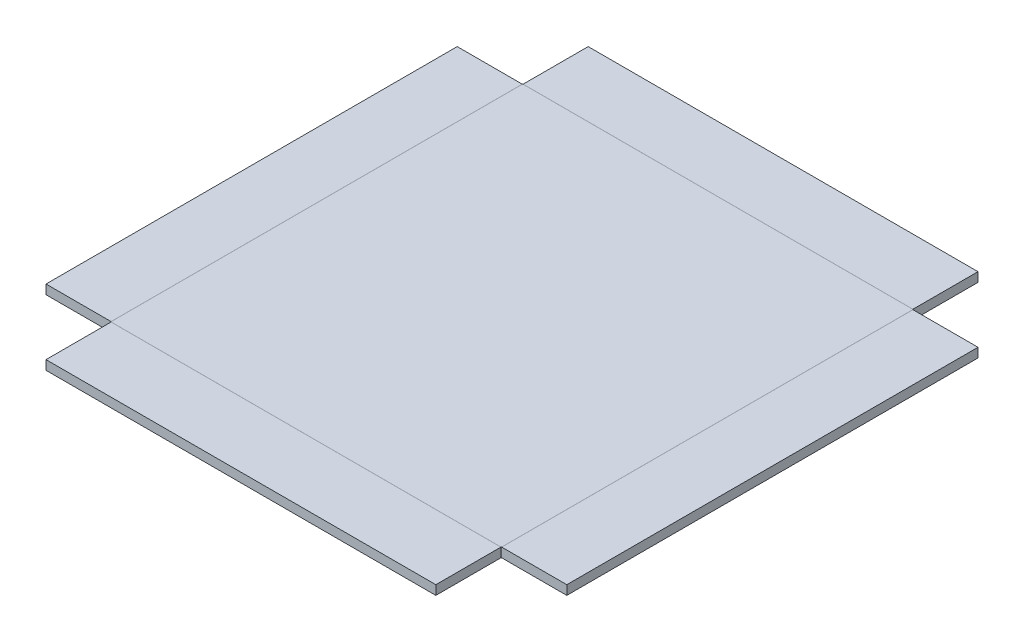
ISO-10303-21;
HEADER;
FILE_DESCRIPTION(('STEP AP214'),'2;1');
FILE_NAME('part.step','',(''),(''),'','','');
FILE_SCHEMA(('AUTOMOTIVE_DESIGN { 1 0 10303 214 1 1 1 1 }'));
ENDSEC;
DATA;
#1=APPLICATION_CONTEXT('core data for automotive mechanical design processes');
#2=APPLICATION_PROTOCOL_DEFINITION('international standard','automotive_design',2000,#1);
#3=PRODUCT_CONTEXT('',#1,'mechanical');
#4=PRODUCT('Part','Part','',(#3));
#5=PRODUCT_RELATED_PRODUCT_CATEGORY('part','',(#4));
#6=PRODUCT_DEFINITION_FORMATION('','',#4);
#7=PRODUCT_DEFINITION_CONTEXT('part definition',#1,'design');
#8=PRODUCT_DEFINITION('design','',#6,#7);
#9=PRODUCT_DEFINITION_SHAPE('','',#8);
#10=(LENGTH_UNIT() NAMED_UNIT(*) SI_UNIT(.MILLI.,.METRE.));
#11=(NAMED_UNIT(*) PLANE_ANGLE_UNIT() SI_UNIT($,.RADIAN.));
#12=(NAMED_UNIT(*) SI_UNIT($,.STERADIAN.) SOLID_ANGLE_UNIT());
#13=UNCERTAINTY_MEASURE_WITH_UNIT(LENGTH_MEASURE(1.E-05),#10,'distance_accuracy_value','');
#14=(GEOMETRIC_REPRESENTATION_CONTEXT(3) GLOBAL_UNCERTAINTY_ASSIGNED_CONTEXT((#13)) GLOBAL_UNIT_ASSIGNED_CONTEXT((#10,
#11,#12)) REPRESENTATION_CONTEXT('',''));
#15=CARTESIAN_POINT('',(0.,0.,0.));
#16=DIRECTION('',(0.,0.,1.));
#17=DIRECTION('',(1.,0.,0.));
#18=AXIS2_PLACEMENT_3D('',#15,#16,#17);
#19=CARTESIAN_POINT('',(0.,-0.254,0.));
#20=DIRECTION('',(0.,-1.,0.));
#21=DIRECTION('',(0.,0.,-1.));
#22=AXIS2_PLACEMENT_3D('',#19,#20,#21);
#23=PLANE('',#22);
#24=DIRECTION('',(0.,0.,-1.));
#25=VECTOR('',#24,1.);
#26=CARTESIAN_POINT('',(5.334,-0.254,5.6261));
#27=LINE('',#26,#25);
#28=CARTESIAN_POINT('',(5.334,-0.254,5.6261));
#29=VERTEX_POINT('',#28);
#30=CARTESIAN_POINT('',(5.334,-0.254,-5.6261));
#31=VERTEX_POINT('',#30);
#32=EDGE_CURVE('E337',#29,#31,#27,.T.);
#33=ORIENTED_EDGE('',*,*,#32,.F.);
#34=DIRECTION('',(1.,0.,0.));
#35=VECTOR('',#34,1.);
#36=CARTESIAN_POINT('',(-5.334,-0.254,5.6261));
#37=LINE('',#36,#35);
#38=CARTESIAN_POINT('',(-5.334,-0.254,5.6261));
#39=VERTEX_POINT('',#38);
#40=EDGE_CURVE('E702',#39,#29,#37,.T.);
#41=ORIENTED_EDGE('',*,*,#40,.F.);
#42=DIRECTION('',(0.,0.,1.));
#43=VECTOR('',#42,1.);
#44=CARTESIAN_POINT('',(-5.334,-0.254,5.6261));
#45=LINE('',#44,#43);
#46=CARTESIAN_POINT('',(-5.334,-0.254,-5.6261));
#47=VERTEX_POINT('',#46);
#48=EDGE_CURVE('E692',#47,#39,#45,.T.);
#49=ORIENTED_EDGE('',*,*,#48,.F.);
#50=DIRECTION('',(-1.,0.,0.));
#51=VECTOR('',#50,1.);
#52=CARTESIAN_POINT('',(-5.334,-0.254,-5.6261));
#53=LINE('',#52,#51);
#54=EDGE_CURVE('E344',#31,#47,#53,.T.);
#55=ORIENTED_EDGE('',*,*,#54,.F.);
#56=EDGE_LOOP('',(#33,#41,#49,#55));
#57=FACE_BOUND('',#56,.T.);
#58=ADVANCED_FACE('F329',(#57),#23,.T.);
#59=CARTESIAN_POINT('',(0.,0.,0.));
#60=DIRECTION('',(0.,-1.,0.));
#61=DIRECTION('',(0.,0.,-1.));
#62=AXIS2_PLACEMENT_3D('',#59,#60,#61);
#63=PLANE('',#62);
#64=DIRECTION('',(0.,0.,-1.));
#65=VECTOR('',#64,1.);
#66=CARTESIAN_POINT('',(5.334,0.,5.6261));
#67=LINE('',#66,#65);
#68=CARTESIAN_POINT('',(5.334,0.,5.62609999999999));
#69=VERTEX_POINT('',#68);
#70=CARTESIAN_POINT('',(5.33399999999999,0.,-5.6261));
#71=VERTEX_POINT('',#70);
#72=EDGE_CURVE('E704',#69,#71,#67,.T.);
#73=ORIENTED_EDGE('',*,*,#72,.T.);
#74=DIRECTION('',(-1.,0.,0.));
#75=VECTOR('',#74,1.);
#76=CARTESIAN_POINT('',(-5.334,0.,-5.6261));
#77=LINE('',#76,#75);
#78=CARTESIAN_POINT('',(-5.334,0.,-5.62609999999999));
#79=VERTEX_POINT('',#78);
#80=EDGE_CURVE('E675',#71,#79,#77,.T.);
#81=ORIENTED_EDGE('',*,*,#80,.T.);
#82=DIRECTION('',(0.,0.,1.));
#83=VECTOR('',#82,1.);
#84=CARTESIAN_POINT('',(-5.334,0.,5.6261));
#85=LINE('',#84,#83);
#86=CARTESIAN_POINT('',(-5.33399999999998,0.,5.6261));
#87=VERTEX_POINT('',#86);
#88=EDGE_CURVE('E682',#79,#87,#85,.T.);
#89=ORIENTED_EDGE('',*,*,#88,.T.);
#90=DIRECTION('',(1.,0.,0.));
#91=VECTOR('',#90,1.);
#92=CARTESIAN_POINT('',(-5.334,0.,5.6261));
#93=LINE('',#92,#91);
#94=EDGE_CURVE('E695',#87,#69,#93,.T.);
#95=ORIENTED_EDGE('',*,*,#94,.T.);
#96=EDGE_LOOP('',(#73,#81,#89,#95));
#97=FACE_BOUND('',#96,.T.);
#98=ADVANCED_FACE('F331',(#97),#63,.F.);
#99=CARTESIAN_POINT('',(-5.334,-0.254,-5.6261));
#100=DIRECTION('',(0.216857826546622,0.,0.976203197631249));
#101=DIRECTION('',(0.976203197631249,0.,-0.216857826546622));
#102=AXIS2_PLACEMENT_3D('',#99,#100,#101);
#103=PLANE('',#102);
#104=DIRECTION('',(0.,1.,0.));
#105=VECTOR('',#104,1.);
#106=CARTESIAN_POINT('',(-5.334,-0.254,-5.6261));
#107=LINE('',#106,#105);
#108=EDGE_CURVE('E689',#47,#79,#107,.T.);
#109=ORIENTED_EDGE('',*,*,#108,.T.);
#110=DIRECTION('',(0.976203197631249,0.,-0.216857826546622));
#111=VECTOR('',#110,1.);
#112=CARTESIAN_POINT('',(-5.334,0.,-5.62609999999999));
#113=LINE('',#112,#111);
#114=CARTESIAN_POINT('',(-5.32501974387893,0.,-5.62809491133502));
#115=VERTEX_POINT('',#114);
#116=EDGE_CURVE('E678',#79,#115,#113,.T.);
#117=ORIENTED_EDGE('',*,*,#116,.T.);
#118=DIRECTION('',(0.,1.,0.));
#119=VECTOR('',#118,1.);
#120=CARTESIAN_POINT('',(-5.32501974387893,-0.254,-5.62809491133503));
#121=LINE('',#120,#119);
#122=CARTESIAN_POINT('',(-5.32501974387893,-0.254,-5.62809491133503));
#123=VERTEX_POINT('',#122);
#124=EDGE_CURVE('E627',#123,#115,#121,.T.);
#125=ORIENTED_EDGE('',*,*,#124,.F.);
#126=DIRECTION('',(0.976203197631249,0.,-0.216857826546622));
#127=VECTOR('',#126,1.);
#128=CARTESIAN_POINT('',(-5.334,-0.254,-5.6261));
#129=LINE('',#128,#127);
#130=EDGE_CURVE('E672',#47,#123,#129,.T.);
#131=ORIENTED_EDGE('',*,*,#130,.F.);
#132=EDGE_LOOP('',(#109,#117,#125,#131));
#133=FACE_BOUND('',#132,.T.);
#134=ADVANCED_FACE('F783',(#133),#103,.F.);
#135=CARTESIAN_POINT('',(5.32501974387893,-0.254,-5.62809491133503));
#136=DIRECTION('',(-0.216857826546622,0.,0.976203197631249));
#137=DIRECTION('',(0.976203197631249,0.,0.216857826546622));
#138=AXIS2_PLACEMENT_3D('',#135,#136,#137);
#139=PLANE('',#138);
#140=DIRECTION('',(0.,1.,0.));
#141=VECTOR('',#140,1.);
#142=CARTESIAN_POINT('',(5.32501974387893,-0.254,-5.62809491133503));
#143=LINE('',#142,#141);
#144=CARTESIAN_POINT('',(5.32501974387893,-0.254,-5.62809491133503));
#145=VERTEX_POINT('',#144);
#146=CARTESIAN_POINT('',(5.32501974387893,0.,-5.62809491133502));
#147=VERTEX_POINT('',#146);
#148=EDGE_CURVE('E664',#145,#147,#143,.T.);
#149=ORIENTED_EDGE('',*,*,#148,.T.);
#150=DIRECTION('',(0.976203197631249,0.,0.216857826546622));
#151=VECTOR('',#150,1.);
#152=CARTESIAN_POINT('',(5.32501974387893,0.,-5.62809491133502));
#153=LINE('',#152,#151);
#154=EDGE_CURVE('E626',#147,#71,#153,.T.);
#155=ORIENTED_EDGE('',*,*,#154,.T.);
#156=DIRECTION('',(0.,1.,0.));
#157=VECTOR('',#156,1.);
#158=CARTESIAN_POINT('',(5.334,-0.254,-5.6261));
#159=LINE('',#158,#157);
#160=EDGE_CURVE('E13',#31,#71,#159,.T.);
#161=ORIENTED_EDGE('',*,*,#160,.F.);
#162=DIRECTION('',(0.976203197631249,0.,0.216857826546622));
#163=VECTOR('',#162,1.);
#164=CARTESIAN_POINT('',(5.32501974387893,-0.254,-5.62809491133503));
#165=LINE('',#164,#163);
#166=EDGE_CURVE('E676',#145,#31,#165,.T.);
#167=ORIENTED_EDGE('',*,*,#166,.F.);
#168=EDGE_LOOP('',(#149,#155,#161,#167));
#169=FACE_BOUND('',#168,.T.);
#170=ADVANCED_FACE('F787',(#169),#139,.F.);
#171=CARTESIAN_POINT('',(0.,-0.254000000000306,0.));
#172=DIRECTION('',(0.,1.,0.));
#173=DIRECTION('',(0.,0.,1.));
#174=AXIS2_PLACEMENT_3D('',#171,#172,#173);
#175=PLANE('',#174);
#176=ORIENTED_EDGE('',*,*,#166,.T.);
#177=ORIENTED_EDGE('',*,*,#54,.T.);
#178=ORIENTED_EDGE('',*,*,#130,.T.);
#179=DIRECTION('',(-1.,0.,0.));
#180=VECTOR('',#179,1.);
#181=CARTESIAN_POINT('',(-5.334,-0.254,-5.62809491133503));
#182=LINE('',#181,#180);
#183=EDGE_CURVE('E639',#145,#123,#182,.T.);
#184=ORIENTED_EDGE('',*,*,#183,.F.);
#185=EDGE_LOOP('',(#176,#177,#178,#184));
#186=FACE_BOUND('',#185,.T.);
#187=ADVANCED_FACE('F791',(#186),#175,.F.);
#188=CARTESIAN_POINT('',(0.,-3.05745012640912E-13,0.));
#189=DIRECTION('',(0.,1.,0.));
#190=DIRECTION('',(0.,0.,1.));
#191=AXIS2_PLACEMENT_3D('',#188,#189,#190);
#192=PLANE('',#191);
#193=ORIENTED_EDGE('',*,*,#154,.F.);
#194=DIRECTION('',(-1.,0.,0.));
#195=VECTOR('',#194,1.);
#196=CARTESIAN_POINT('',(-5.334,0.,-5.62809491133503));
#197=LINE('',#196,#195);
#198=EDGE_CURVE('E616',#147,#115,#197,.T.);
#199=ORIENTED_EDGE('',*,*,#198,.T.);
#200=ORIENTED_EDGE('',*,*,#116,.F.);
#201=ORIENTED_EDGE('',*,*,#80,.F.);
#202=EDGE_LOOP('',(#193,#199,#200,#201));
#203=FACE_BOUND('',#202,.T.);
#204=ADVANCED_FACE('F793',(#203),#192,.T.);
#205=CARTESIAN_POINT('',(-5.334,0.,-7.40609491133503));
#206=DIRECTION('',(0.,0.,-1.));
#207=DIRECTION('',(0.,1.,0.));
#208=AXIS2_PLACEMENT_3D('',#205,#206,#207);
#209=PLANE('',#208);
#210=DIRECTION('',(0.,1.,0.));
#211=VECTOR('',#210,1.);
#212=CARTESIAN_POINT('',(5.32501974387893,0.,-7.40609491133503));
#213=LINE('',#212,#211);
#214=CARTESIAN_POINT('',(5.32501974387893,-0.253999999999988,-7.40609491133503));
#215=VERTEX_POINT('',#214);
#216=CARTESIAN_POINT('',(5.32501974387893,0.,-7.40609491133503));
#217=VERTEX_POINT('',#216);
#218=EDGE_CURVE('E644',#215,#217,#213,.T.);
#219=ORIENTED_EDGE('',*,*,#218,.F.);
#220=DIRECTION('',(1.,0.,0.));
#221=VECTOR('',#220,1.);
#222=CARTESIAN_POINT('',(-5.334,-0.253999999999988,-7.40609491133503));
#223=LINE('',#222,#221);
#224=CARTESIAN_POINT('',(-5.32501974387893,-0.253999999999988,-7.40609491133503));
#225=VERTEX_POINT('',#224);
#226=EDGE_CURVE('E632',#225,#215,#223,.T.);
#227=ORIENTED_EDGE('',*,*,#226,.F.);
#228=DIRECTION('',(0.,1.,0.));
#229=VECTOR('',#228,1.);
#230=CARTESIAN_POINT('',(-5.32501974387893,0.,-7.40609491133503));
#231=LINE('',#230,#229);
#232=CARTESIAN_POINT('',(-5.32501974387893,0.,-7.40609491133503));
#233=VERTEX_POINT('',#232);
#234=EDGE_CURVE('E661',#225,#233,#231,.T.);
#235=ORIENTED_EDGE('',*,*,#234,.T.);
#236=DIRECTION('',(1.,0.,0.));
#237=VECTOR('',#236,1.);
#238=CARTESIAN_POINT('',(-5.334,0.,-7.40609491133503));
#239=LINE('',#238,#237);
#240=EDGE_CURVE('E656',#233,#217,#239,.T.);
#241=ORIENTED_EDGE('',*,*,#240,.T.);
#242=EDGE_LOOP('',(#219,#227,#235,#241));
#243=FACE_BOUND('',#242,.T.);
#244=ADVANCED_FACE('F796',(#243),#209,.T.);
#245=CARTESIAN_POINT('',(0.,0.,-5.37409491133501));
#246=DIRECTION('',(0.,-1.,0.));
#247=DIRECTION('',(0.,0.,-1.));
#248=AXIS2_PLACEMENT_3D('',#245,#246,#247);
#249=PLANE('',#248);
#250=ORIENTED_EDGE('',*,*,#198,.F.);
#251=DIRECTION('',(0.,0.,-1.));
#252=VECTOR('',#251,1.);
#253=CARTESIAN_POINT('',(5.32501974387893,0.,-5.37409491133501));
#254=LINE('',#253,#252);
#255=EDGE_CURVE('E652',#147,#217,#254,.T.);
#256=ORIENTED_EDGE('',*,*,#255,.T.);
#257=ORIENTED_EDGE('',*,*,#240,.F.);
#258=DIRECTION('',(0.,0.,-1.));
#259=VECTOR('',#258,1.);
#260=CARTESIAN_POINT('',(-5.32501974387893,0.,-5.37409491133501));
#261=LINE('',#260,#259);
#262=EDGE_CURVE('E624',#115,#233,#261,.T.);
#263=ORIENTED_EDGE('',*,*,#262,.F.);
#264=EDGE_LOOP('',(#250,#256,#257,#263));
#265=FACE_BOUND('',#264,.T.);
#266=ADVANCED_FACE('F813',(#265),#249,.F.);
#267=CARTESIAN_POINT('',(5.32501974387893,-0.254,-5.62809491133503));
#268=DIRECTION('',(-1.,0.,0.));
#269=DIRECTION('',(0.,-1.,0.));
#270=AXIS2_PLACEMENT_3D('',#267,#268,#269);
#271=PLANE('',#270);
#272=DIRECTION('',(0.,0.,-1.));
#273=VECTOR('',#272,1.);
#274=CARTESIAN_POINT('',(5.32501974387893,-0.254,-5.62809491133503));
#275=LINE('',#274,#273);
#276=EDGE_CURVE('E649',#145,#215,#275,.T.);
#277=ORIENTED_EDGE('',*,*,#276,.T.);
#278=ORIENTED_EDGE('',*,*,#218,.T.);
#279=ORIENTED_EDGE('',*,*,#255,.F.);
#280=ORIENTED_EDGE('',*,*,#148,.F.);
#281=EDGE_LOOP('',(#277,#278,#279,#280));
#282=FACE_BOUND('',#281,.T.);
#283=ADVANCED_FACE('F809',(#282),#271,.F.);
#284=CARTESIAN_POINT('',(0.,-0.254000000000002,-5.37409491133501));
#285=DIRECTION('',(0.,-1.,0.));
#286=DIRECTION('',(0.,0.,-1.));
#287=AXIS2_PLACEMENT_3D('',#284,#285,#286);
#288=PLANE('',#287);
#289=ORIENTED_EDGE('',*,*,#276,.F.);
#290=ORIENTED_EDGE('',*,*,#183,.T.);
#291=DIRECTION('',(0.,0.,-1.));
#292=VECTOR('',#291,1.);
#293=CARTESIAN_POINT('',(-5.32501974387893,-0.254,-5.62809491133503));
#294=LINE('',#293,#292);
#295=EDGE_CURVE('E636',#123,#225,#294,.T.);
#296=ORIENTED_EDGE('',*,*,#295,.T.);
#297=ORIENTED_EDGE('',*,*,#226,.T.);
#298=EDGE_LOOP('',(#289,#290,#296,#297));
#299=FACE_BOUND('',#298,.T.);
#300=ADVANCED_FACE('F805',(#299),#288,.T.);
#301=CARTESIAN_POINT('',(-5.32501974387893,-0.254,-5.62809491133503));
#302=DIRECTION('',(-1.,0.,0.));
#303=DIRECTION('',(0.,-1.,0.));
#304=AXIS2_PLACEMENT_3D('',#301,#302,#303);
#305=PLANE('',#304);
#306=ORIENTED_EDGE('',*,*,#234,.F.);
#307=ORIENTED_EDGE('',*,*,#295,.F.);
#308=ORIENTED_EDGE('',*,*,#124,.T.);
#309=ORIENTED_EDGE('',*,*,#262,.T.);
#310=EDGE_LOOP('',(#306,#307,#308,#309));
#311=FACE_BOUND('',#310,.T.);
#312=ADVANCED_FACE('F801',(#311),#305,.T.);
#313=CARTESIAN_POINT('',(-5.334,-0.254,5.6261));
#314=DIRECTION('',(0.976203197631269,0.,-0.216857826546532));
#315=DIRECTION('',(-0.216857826546532,0.,-0.976203197631269));
#316=AXIS2_PLACEMENT_3D('',#313,#314,#315);
#317=PLANE('',#316);
#318=DIRECTION('',(0.,1.,0.));
#319=VECTOR('',#318,1.);
#320=CARTESIAN_POINT('',(-5.334,-0.254,5.6261));
#321=LINE('',#320,#319);
#322=EDGE_CURVE('E699',#39,#87,#321,.T.);
#323=ORIENTED_EDGE('',*,*,#322,.T.);
#324=DIRECTION('',(-0.216857826546532,0.,-0.976203197631269));
#325=VECTOR('',#324,1.);
#326=CARTESIAN_POINT('',(-5.33399999999998,0.,5.6261));
#327=LINE('',#326,#325);
#328=CARTESIAN_POINT('',(-5.33599491133501,0.,5.61711974387893));
#329=VERTEX_POINT('',#328);
#330=EDGE_CURVE('E620',#87,#329,#327,.T.);
#331=ORIENTED_EDGE('',*,*,#330,.T.);
#332=DIRECTION('',(0.,1.,0.));
#333=VECTOR('',#332,1.);
#334=CARTESIAN_POINT('',(-5.33599491133503,-0.254,5.61711974387893));
#335=LINE('',#334,#333);
#336=CARTESIAN_POINT('',(-5.33599491133503,-0.254,5.61711974387893));
#337=VERTEX_POINT('',#336);
#338=EDGE_CURVE('E572',#337,#329,#335,.T.);
#339=ORIENTED_EDGE('',*,*,#338,.F.);
#340=DIRECTION('',(-0.216857826546532,0.,-0.976203197631269));
#341=VECTOR('',#340,1.);
#342=CARTESIAN_POINT('',(-5.334,-0.254,5.6261));
#343=LINE('',#342,#341);
#344=EDGE_CURVE('E613',#39,#337,#343,.T.);
#345=ORIENTED_EDGE('',*,*,#344,.F.);
#346=EDGE_LOOP('',(#323,#331,#339,#345));
#347=FACE_BOUND('',#346,.T.);
#348=ADVANCED_FACE('F804',(#347),#317,.F.);
#349=CARTESIAN_POINT('',(-5.33599491133503,-0.254,-5.61711974387893));
#350=DIRECTION('',(0.976203197631269,0.,0.216857826546532));
#351=DIRECTION('',(0.216857826546532,0.,-0.976203197631269));
#352=AXIS2_PLACEMENT_3D('',#349,#350,#351);
#353=PLANE('',#352);
#354=DIRECTION('',(0.,1.,0.));
#355=VECTOR('',#354,1.);
#356=CARTESIAN_POINT('',(-5.33599491133503,-0.254,-5.61711974387893));
#357=LINE('',#356,#355);
#358=CARTESIAN_POINT('',(-5.33599491133503,-0.254,-5.61711974387893));
#359=VERTEX_POINT('',#358);
#360=CARTESIAN_POINT('',(-5.33599491133501,0.,-5.61711974387893));
#361=VERTEX_POINT('',#360);
#362=EDGE_CURVE('E607',#359,#361,#357,.T.);
#363=ORIENTED_EDGE('',*,*,#362,.T.);
#364=DIRECTION('',(0.216857826546532,0.,-0.976203197631269));
#365=VECTOR('',#364,1.);
#366=CARTESIAN_POINT('',(-5.33599491133501,0.,-5.61711974387893));
#367=LINE('',#366,#365);
#368=EDGE_CURVE('E571',#361,#79,#367,.T.);
#369=ORIENTED_EDGE('',*,*,#368,.T.);
#370=ORIENTED_EDGE('',*,*,#108,.F.);
#371=DIRECTION('',(0.216857826546532,0.,-0.976203197631269));
#372=VECTOR('',#371,1.);
#373=CARTESIAN_POINT('',(-5.33599491133503,-0.254,-5.61711974387893));
#374=LINE('',#373,#372);
#375=EDGE_CURVE('E617',#359,#47,#374,.T.);
#376=ORIENTED_EDGE('',*,*,#375,.F.);
#377=EDGE_LOOP('',(#363,#369,#370,#376));
#378=FACE_BOUND('',#377,.T.);
#379=ADVANCED_FACE('F823',(#378),#353,.F.);
#380=CARTESIAN_POINT('',(0.,-0.25400000000029,0.));
#381=DIRECTION('',(0.,1.,0.));
#382=DIRECTION('',(-1.,0.,0.));
#383=AXIS2_PLACEMENT_3D('',#380,#381,#382);
#384=PLANE('',#383);
#385=ORIENTED_EDGE('',*,*,#375,.T.);
#386=ORIENTED_EDGE('',*,*,#48,.T.);
#387=ORIENTED_EDGE('',*,*,#344,.T.);
#388=DIRECTION('',(0.,0.,1.));
#389=VECTOR('',#388,1.);
#390=CARTESIAN_POINT('',(-5.33599491133503,-0.254,5.6261));
#391=LINE('',#390,#389);
#392=EDGE_CURVE('E584',#359,#337,#391,.T.);
#393=ORIENTED_EDGE('',*,*,#392,.F.);
#394=EDGE_LOOP('',(#385,#386,#387,#393));
#395=FACE_BOUND('',#394,.T.);
#396=ADVANCED_FACE('F827',(#395),#384,.F.);
#397=CARTESIAN_POINT('',(0.,-2.89915660922624E-13,0.));
#398=DIRECTION('',(0.,1.,0.));
#399=DIRECTION('',(-1.,0.,0.));
#400=AXIS2_PLACEMENT_3D('',#397,#398,#399);
#401=PLANE('',#400);
#402=ORIENTED_EDGE('',*,*,#368,.F.);
#403=DIRECTION('',(0.,0.,1.));
#404=VECTOR('',#403,1.);
#405=CARTESIAN_POINT('',(-5.33599491133503,0.,5.6261));
#406=LINE('',#405,#404);
#407=EDGE_CURVE('E561',#361,#329,#406,.T.);
#408=ORIENTED_EDGE('',*,*,#407,.T.);
#409=ORIENTED_EDGE('',*,*,#330,.F.);
#410=ORIENTED_EDGE('',*,*,#88,.F.);
#411=EDGE_LOOP('',(#402,#408,#409,#410));
#412=FACE_BOUND('',#411,.T.);
#413=ADVANCED_FACE('F829',(#412),#401,.T.);
#414=CARTESIAN_POINT('',(-7.11399491133503,0.,5.6261));
#415=DIRECTION('',(-1.,0.,0.));
#416=DIRECTION('',(0.,-1.,0.));
#417=AXIS2_PLACEMENT_3D('',#414,#415,#416);
#418=PLANE('',#417);
#419=DIRECTION('',(0.,1.,0.));
#420=VECTOR('',#419,1.);
#421=CARTESIAN_POINT('',(-7.11399491133503,0.,-5.61711974387893));
#422=LINE('',#421,#420);
#423=CARTESIAN_POINT('',(-7.11399491133503,-0.253999999999988,-5.61711974387893));
#424=VERTEX_POINT('',#423);
#425=CARTESIAN_POINT('',(-7.11399491133503,0.,-5.61711974387893));
#426=VERTEX_POINT('',#425);
#427=EDGE_CURVE('E589',#424,#426,#422,.T.);
#428=ORIENTED_EDGE('',*,*,#427,.F.);
#429=DIRECTION('',(0.,0.,-1.));
#430=VECTOR('',#429,1.);
#431=CARTESIAN_POINT('',(-7.11399491133503,-0.253999999999988,5.6261));
#432=LINE('',#431,#430);
#433=CARTESIAN_POINT('',(-7.11399491133503,-0.253999999999988,5.61711974387893));
#434=VERTEX_POINT('',#433);
#435=EDGE_CURVE('E577',#434,#424,#432,.T.);
#436=ORIENTED_EDGE('',*,*,#435,.F.);
#437=DIRECTION('',(0.,1.,0.));
#438=VECTOR('',#437,1.);
#439=CARTESIAN_POINT('',(-7.11399491133503,0.,5.61711974387893));
#440=LINE('',#439,#438);
#441=CARTESIAN_POINT('',(-7.11399491133503,0.,5.61711974387893));
#442=VERTEX_POINT('',#441);
#443=EDGE_CURVE('E604',#434,#442,#440,.T.);
#444=ORIENTED_EDGE('',*,*,#443,.T.);
#445=DIRECTION('',(0.,0.,-1.));
#446=VECTOR('',#445,1.);
#447=CARTESIAN_POINT('',(-7.11399491133503,0.,5.6261));
#448=LINE('',#447,#446);
#449=EDGE_CURVE('E601',#442,#426,#448,.T.);
#450=ORIENTED_EDGE('',*,*,#449,.T.);
#451=EDGE_LOOP('',(#428,#436,#444,#450));
#452=FACE_BOUND('',#451,.T.);
#453=ADVANCED_FACE('F832',(#452),#418,.T.);
#454=CARTESIAN_POINT('',(-5.08199491133501,0.,0.));
#455=DIRECTION('',(0.,-1.,0.));
#456=DIRECTION('',(1.,0.,0.));
#457=AXIS2_PLACEMENT_3D('',#454,#455,#456);
#458=PLANE('',#457);
#459=ORIENTED_EDGE('',*,*,#407,.F.);
#460=DIRECTION('',(-1.,0.,0.));
#461=VECTOR('',#460,1.);
#462=CARTESIAN_POINT('',(-5.08199491133501,0.,-5.61711974387893));
#463=LINE('',#462,#461);
#464=EDGE_CURVE('E597',#361,#426,#463,.T.);
#465=ORIENTED_EDGE('',*,*,#464,.T.);
#466=ORIENTED_EDGE('',*,*,#449,.F.);
#467=DIRECTION('',(-1.,0.,0.));
#468=VECTOR('',#467,1.);
#469=CARTESIAN_POINT('',(-5.08199491133501,0.,5.61711974387893));
#470=LINE('',#469,#468);
#471=EDGE_CURVE('E569',#329,#442,#470,.T.);
#472=ORIENTED_EDGE('',*,*,#471,.F.);
#473=EDGE_LOOP('',(#459,#465,#466,#472));
#474=FACE_BOUND('',#473,.T.);
#475=ADVANCED_FACE('F843',(#474),#458,.F.);
#476=CARTESIAN_POINT('',(-5.33599491133503,-0.254,-5.61711974387893));
#477=DIRECTION('',(0.,0.,1.));
#478=DIRECTION('',(-1.,0.,0.));
#479=AXIS2_PLACEMENT_3D('',#476,#477,#478);
#480=PLANE('',#479);
#481=DIRECTION('',(-1.,0.,0.));
#482=VECTOR('',#481,1.);
#483=CARTESIAN_POINT('',(-5.33599491133503,-0.254,-5.61711974387893));
#484=LINE('',#483,#482);
#485=EDGE_CURVE('E594',#359,#424,#484,.T.);
#486=ORIENTED_EDGE('',*,*,#485,.T.);
#487=ORIENTED_EDGE('',*,*,#427,.T.);
#488=ORIENTED_EDGE('',*,*,#464,.F.);
#489=ORIENTED_EDGE('',*,*,#362,.F.);
#490=EDGE_LOOP('',(#486,#487,#488,#489));
#491=FACE_BOUND('',#490,.T.);
#492=ADVANCED_FACE('F839',(#491),#480,.F.);
#493=CARTESIAN_POINT('',(-5.08199491133501,-0.254000000000002,0.));
#494=DIRECTION('',(0.,-1.,0.));
#495=DIRECTION('',(1.,0.,0.));
#496=AXIS2_PLACEMENT_3D('',#493,#494,#495);
#497=PLANE('',#496);
#498=ORIENTED_EDGE('',*,*,#485,.F.);
#499=ORIENTED_EDGE('',*,*,#392,.T.);
#500=DIRECTION('',(-1.,0.,0.));
#501=VECTOR('',#500,1.);
#502=CARTESIAN_POINT('',(-5.33599491133503,-0.254,5.61711974387893));
#503=LINE('',#502,#501);
#504=EDGE_CURVE('E581',#337,#434,#503,.T.);
#505=ORIENTED_EDGE('',*,*,#504,.T.);
#506=ORIENTED_EDGE('',*,*,#435,.T.);
#507=EDGE_LOOP('',(#498,#499,#505,#506));
#508=FACE_BOUND('',#507,.T.);
#509=ADVANCED_FACE('F775',(#508),#497,.T.);
#510=CARTESIAN_POINT('',(-5.33599491133503,-0.254,5.61711974387893));
#511=DIRECTION('',(0.,0.,1.));
#512=DIRECTION('',(-1.,0.,0.));
#513=AXIS2_PLACEMENT_3D('',#510,#511,#512);
#514=PLANE('',#513);
#515=ORIENTED_EDGE('',*,*,#443,.F.);
#516=ORIENTED_EDGE('',*,*,#504,.F.);
#517=ORIENTED_EDGE('',*,*,#338,.T.);
#518=ORIENTED_EDGE('',*,*,#471,.T.);
#519=EDGE_LOOP('',(#515,#516,#517,#518));
#520=FACE_BOUND('',#519,.T.);
#521=ADVANCED_FACE('F766',(#520),#514,.T.);
#522=CARTESIAN_POINT('',(5.334,-0.254,5.6261));
#523=DIRECTION('',(-0.216857826546622,0.,-0.976203197631249));
#524=DIRECTION('',(-0.976203197631249,0.,0.216857826546622));
#525=AXIS2_PLACEMENT_3D('',#522,#523,#524);
#526=PLANE('',#525);
#527=DIRECTION('',(0.,1.,0.));
#528=VECTOR('',#527,1.);
#529=CARTESIAN_POINT('',(5.334,-0.254,5.6261));
#530=LINE('',#529,#528);
#531=EDGE_CURVE('E709',#29,#69,#530,.T.);
#532=ORIENTED_EDGE('',*,*,#531,.T.);
#533=DIRECTION('',(-0.976203197631249,0.,0.216857826546622));
#534=VECTOR('',#533,1.);
#535=CARTESIAN_POINT('',(5.334,0.,5.62609999999999));
#536=LINE('',#535,#534);
#537=CARTESIAN_POINT('',(5.32501974387893,0.,5.62809491133502));
#538=VERTEX_POINT('',#537);
#539=EDGE_CURVE('E565',#69,#538,#536,.T.);
#540=ORIENTED_EDGE('',*,*,#539,.T.);
#541=DIRECTION('',(0.,1.,0.));
#542=VECTOR('',#541,1.);
#543=CARTESIAN_POINT('',(5.32501974387893,-0.254,5.62809491133503));
#544=LINE('',#543,#542);
#545=CARTESIAN_POINT('',(5.32501974387893,-0.254,5.62809491133503));
#546=VERTEX_POINT('',#545);
#547=EDGE_CURVE('E519',#546,#538,#544,.T.);
#548=ORIENTED_EDGE('',*,*,#547,.F.);
#549=DIRECTION('',(-0.976203197631249,0.,0.216857826546622));
#550=VECTOR('',#549,1.);
#551=CARTESIAN_POINT('',(5.334,-0.254,5.6261));
#552=LINE('',#551,#550);
#553=EDGE_CURVE('E352',#29,#546,#552,.T.);
#554=ORIENTED_EDGE('',*,*,#553,.F.);
#555=EDGE_LOOP('',(#532,#540,#548,#554));
#556=FACE_BOUND('',#555,.T.);
#557=ADVANCED_FACE('F763',(#556),#526,.F.);
#558=CARTESIAN_POINT('',(-5.32501974387893,-0.254,5.62809491133503));
#559=DIRECTION('',(0.216857826546622,0.,-0.976203197631249));
#560=DIRECTION('',(-0.976203197631249,0.,-0.216857826546622));
#561=AXIS2_PLACEMENT_3D('',#558,#559,#560);
#562=PLANE('',#561);
#563=DIRECTION('',(0.,1.,0.));
#564=VECTOR('',#563,1.);
#565=CARTESIAN_POINT('',(-5.32501974387893,-0.254,5.62809491133503));
#566=LINE('',#565,#564);
#567=CARTESIAN_POINT('',(-5.32501974387893,-0.254,5.62809491133503));
#568=VERTEX_POINT('',#567);
#569=CARTESIAN_POINT('',(-5.32501974387893,0.,5.62809491133502));
#570=VERTEX_POINT('',#569);
#571=EDGE_CURVE('E554',#568,#570,#566,.T.);
#572=ORIENTED_EDGE('',*,*,#571,.T.);
#573=DIRECTION('',(-0.976203197631249,0.,-0.216857826546622));
#574=VECTOR('',#573,1.);
#575=CARTESIAN_POINT('',(-5.32501974387893,0.,5.62809491133502));
#576=LINE('',#575,#574);
#577=EDGE_CURVE('E518',#570,#87,#576,.T.);
#578=ORIENTED_EDGE('',*,*,#577,.T.);
#579=ORIENTED_EDGE('',*,*,#322,.F.);
#580=DIRECTION('',(-0.976203197631249,0.,-0.216857826546622));
#581=VECTOR('',#580,1.);
#582=CARTESIAN_POINT('',(-5.32501974387893,-0.254,5.62809491133503));
#583=LINE('',#582,#581);
#584=EDGE_CURVE('E562',#568,#39,#583,.T.);
#585=ORIENTED_EDGE('',*,*,#584,.F.);
#586=EDGE_LOOP('',(#572,#578,#579,#585));
#587=FACE_BOUND('',#586,.T.);
#588=ADVANCED_FACE('F765',(#587),#562,.F.);
#589=CARTESIAN_POINT('',(0.,-0.254000000000306,0.));
#590=DIRECTION('',(0.,1.,0.));
#591=DIRECTION('',(0.,0.,1.));
#592=AXIS2_PLACEMENT_3D('',#589,#590,#591);
#593=PLANE('',#592);
#594=ORIENTED_EDGE('',*,*,#584,.T.);
#595=ORIENTED_EDGE('',*,*,#40,.T.);
#596=ORIENTED_EDGE('',*,*,#553,.T.);
#597=DIRECTION('',(1.,0.,0.));
#598=VECTOR('',#597,1.);
#599=CARTESIAN_POINT('',(5.334,-0.254,5.62809491133503));
#600=LINE('',#599,#598);
#601=EDGE_CURVE('E531',#568,#546,#600,.T.);
#602=ORIENTED_EDGE('',*,*,#601,.F.);
#603=EDGE_LOOP('',(#594,#595,#596,#602));
#604=FACE_BOUND('',#603,.T.);
#605=ADVANCED_FACE('F772',(#604),#593,.F.);
#606=CARTESIAN_POINT('',(0.,-3.05745012640912E-13,0.));
#607=DIRECTION('',(0.,1.,0.));
#608=DIRECTION('',(0.,0.,1.));
#609=AXIS2_PLACEMENT_3D('',#606,#607,#608);
#610=PLANE('',#609);
#611=ORIENTED_EDGE('',*,*,#577,.F.);
#612=DIRECTION('',(1.,0.,0.));
#613=VECTOR('',#612,1.);
#614=CARTESIAN_POINT('',(5.334,0.,5.62809491133503));
#615=LINE('',#614,#613);
#616=EDGE_CURVE('E507',#570,#538,#615,.T.);
#617=ORIENTED_EDGE('',*,*,#616,.T.);
#618=ORIENTED_EDGE('',*,*,#539,.F.);
#619=ORIENTED_EDGE('',*,*,#94,.F.);
#620=EDGE_LOOP('',(#611,#617,#618,#619));
#621=FACE_BOUND('',#620,.T.);
#622=ADVANCED_FACE('F760',(#621),#610,.T.);
#623=CARTESIAN_POINT('',(5.334,0.,7.40609491133503));
#624=DIRECTION('',(0.,0.,1.));
#625=DIRECTION('',(0.,-1.,0.));
#626=AXIS2_PLACEMENT_3D('',#623,#624,#625);
#627=PLANE('',#626);
#628=DIRECTION('',(0.,1.,0.));
#629=VECTOR('',#628,1.);
#630=CARTESIAN_POINT('',(-5.32501974387893,0.,7.40609491133503));
#631=LINE('',#630,#629);
#632=CARTESIAN_POINT('',(-5.32501974387893,-0.253999999999988,7.40609491133503));
#633=VERTEX_POINT('',#632);
#634=CARTESIAN_POINT('',(-5.32501974387893,0.,7.40609491133503));
#635=VERTEX_POINT('',#634);
#636=EDGE_CURVE('E536',#633,#635,#631,.T.);
#637=ORIENTED_EDGE('',*,*,#636,.F.);
#638=DIRECTION('',(-1.,0.,0.));
#639=VECTOR('',#638,1.);
#640=CARTESIAN_POINT('',(5.334,-0.253999999999988,7.40609491133503));
#641=LINE('',#640,#639);
#642=CARTESIAN_POINT('',(5.32501974387893,-0.253999999999988,7.40609491133503));
#643=VERTEX_POINT('',#642);
#644=EDGE_CURVE('E524',#643,#633,#641,.T.);
#645=ORIENTED_EDGE('',*,*,#644,.F.);
#646=DIRECTION('',(0.,1.,0.));
#647=VECTOR('',#646,1.);
#648=CARTESIAN_POINT('',(5.32501974387893,0.,7.40609491133503));
#649=LINE('',#648,#647);
#650=CARTESIAN_POINT('',(5.32501974387893,0.,7.40609491133503));
#651=VERTEX_POINT('',#650);
#652=EDGE_CURVE('E551',#643,#651,#649,.T.);
#653=ORIENTED_EDGE('',*,*,#652,.T.);
#654=DIRECTION('',(-1.,0.,0.));
#655=VECTOR('',#654,1.);
#656=CARTESIAN_POINT('',(5.334,0.,7.40609491133503));
#657=LINE('',#656,#655);
#658=EDGE_CURVE('E548',#651,#635,#657,.T.);
#659=ORIENTED_EDGE('',*,*,#658,.T.);
#660=EDGE_LOOP('',(#637,#645,#653,#659));
#661=FACE_BOUND('',#660,.T.);
#662=ADVANCED_FACE('F882',(#661),#627,.T.);
#663=CARTESIAN_POINT('',(0.,0.,5.37409491133501));
#664=DIRECTION('',(0.,-1.,0.));
#665=DIRECTION('',(0.,0.,-1.));
#666=AXIS2_PLACEMENT_3D('',#663,#664,#665);
#667=PLANE('',#666);
#668=ORIENTED_EDGE('',*,*,#616,.F.);
#669=DIRECTION('',(0.,0.,1.));
#670=VECTOR('',#669,1.);
#671=CARTESIAN_POINT('',(-5.32501974387893,0.,5.37409491133501));
#672=LINE('',#671,#670);
#673=EDGE_CURVE('E544',#570,#635,#672,.T.);
#674=ORIENTED_EDGE('',*,*,#673,.T.);
#675=ORIENTED_EDGE('',*,*,#658,.F.);
#676=DIRECTION('',(0.,0.,1.));
#677=VECTOR('',#676,1.);
#678=CARTESIAN_POINT('',(5.32501974387893,0.,5.37409491133501));
#679=LINE('',#678,#677);
#680=EDGE_CURVE('E516',#538,#651,#679,.T.);
#681=ORIENTED_EDGE('',*,*,#680,.F.);
#682=EDGE_LOOP('',(#668,#674,#675,#681));
#683=FACE_BOUND('',#682,.T.);
#684=ADVANCED_FACE('F877',(#683),#667,.F.);
#685=CARTESIAN_POINT('',(-5.32501974387893,-0.254,5.62809491133503));
#686=DIRECTION('',(1.,0.,0.));
#687=DIRECTION('',(0.,-1.,0.));
#688=AXIS2_PLACEMENT_3D('',#685,#686,#687);
#689=PLANE('',#688);
#690=DIRECTION('',(0.,0.,1.));
#691=VECTOR('',#690,1.);
#692=CARTESIAN_POINT('',(-5.32501974387893,-0.254,5.62809491133503));
#693=LINE('',#692,#691);
#694=EDGE_CURVE('E541',#568,#633,#693,.T.);
#695=ORIENTED_EDGE('',*,*,#694,.T.);
#696=ORIENTED_EDGE('',*,*,#636,.T.);
#697=ORIENTED_EDGE('',*,*,#673,.F.);
#698=ORIENTED_EDGE('',*,*,#571,.F.);
#699=EDGE_LOOP('',(#695,#696,#697,#698));
#700=FACE_BOUND('',#699,.T.);
#701=ADVANCED_FACE('F875',(#700),#689,.F.);
#702=CARTESIAN_POINT('',(0.,-0.254000000000002,5.37409491133501));
#703=DIRECTION('',(0.,-1.,0.));
#704=DIRECTION('',(0.,0.,-1.));
#705=AXIS2_PLACEMENT_3D('',#702,#703,#704);
#706=PLANE('',#705);
#707=ORIENTED_EDGE('',*,*,#694,.F.);
#708=ORIENTED_EDGE('',*,*,#601,.T.);
#709=DIRECTION('',(0.,0.,1.));
#710=VECTOR('',#709,1.);
#711=CARTESIAN_POINT('',(5.32501974387893,-0.254,5.62809491133503));
#712=LINE('',#711,#710);
#713=EDGE_CURVE('E528',#546,#643,#712,.T.);
#714=ORIENTED_EDGE('',*,*,#713,.T.);
#715=ORIENTED_EDGE('',*,*,#644,.T.);
#716=EDGE_LOOP('',(#707,#708,#714,#715));
#717=FACE_BOUND('',#716,.T.);
#718=ADVANCED_FACE('F869',(#717),#706,.T.);
#719=CARTESIAN_POINT('',(5.32501974387893,-0.254,5.62809491133503));
#720=DIRECTION('',(1.,0.,0.));
#721=DIRECTION('',(0.,-1.,0.));
#722=AXIS2_PLACEMENT_3D('',#719,#720,#721);
#723=PLANE('',#722);
#724=ORIENTED_EDGE('',*,*,#652,.F.);
#725=ORIENTED_EDGE('',*,*,#713,.F.);
#726=ORIENTED_EDGE('',*,*,#547,.T.);
#727=ORIENTED_EDGE('',*,*,#680,.T.);
#728=EDGE_LOOP('',(#724,#725,#726,#727));
#729=FACE_BOUND('',#728,.T.);
#730=ADVANCED_FACE('F880',(#729),#723,.T.);
#731=CARTESIAN_POINT('',(5.334,-0.254,-5.6261));
#732=DIRECTION('',(-0.976203197631269,0.,0.216857826546532));
#733=DIRECTION('',(0.216857826546532,0.,0.976203197631269));
#734=AXIS2_PLACEMENT_3D('',#731,#732,#733);
#735=PLANE('',#734);
#736=ORIENTED_EDGE('',*,*,#160,.T.);
#737=DIRECTION('',(0.216857826546532,0.,0.976203197631269));
#738=VECTOR('',#737,1.);
#739=CARTESIAN_POINT('',(5.33399999999999,0.,-5.6261));
#740=LINE('',#739,#738);
#741=CARTESIAN_POINT('',(5.33599491133502,0.,-5.61711974387893));
#742=VERTEX_POINT('',#741);
#743=EDGE_CURVE('E511',#71,#742,#740,.T.);
#744=ORIENTED_EDGE('',*,*,#743,.T.);
#745=DIRECTION('',(0.,1.,0.));
#746=VECTOR('',#745,1.);
#747=CARTESIAN_POINT('',(5.33599491133503,-0.254,-5.61711974387893));
#748=LINE('',#747,#746);
#749=CARTESIAN_POINT('',(5.33599491133503,-0.254,-5.61711974387893));
#750=VERTEX_POINT('',#749);
#751=EDGE_CURVE('E479',#750,#742,#748,.T.);
#752=ORIENTED_EDGE('',*,*,#751,.F.);
#753=DIRECTION('',(0.216857826546532,0.,0.976203197631269));
#754=VECTOR('',#753,1.);
#755=CARTESIAN_POINT('',(5.334,-0.254,-5.6261));
#756=LINE('',#755,#754);
#757=EDGE_CURVE('E504',#31,#750,#756,.T.);
#758=ORIENTED_EDGE('',*,*,#757,.F.);
#759=EDGE_LOOP('',(#736,#744,#752,#758));
#760=FACE_BOUND('',#759,.T.);
#761=ADVANCED_FACE('F720',(#760),#735,.F.);
#762=CARTESIAN_POINT('',(5.33599491133503,-0.254,5.61711974387893));
#763=DIRECTION('',(-0.976203197631269,0.,-0.216857826546532));
#764=DIRECTION('',(-0.216857826546532,0.,0.976203197631269));
#765=AXIS2_PLACEMENT_3D('',#762,#763,#764);
#766=PLANE('',#765);
#767=DIRECTION('',(0.,1.,0.));
#768=VECTOR('',#767,1.);
#769=CARTESIAN_POINT('',(5.33599491133503,-0.254,5.61711974387893));
#770=LINE('',#769,#768);
#771=CARTESIAN_POINT('',(5.33599491133503,-0.254,5.61711974387893));
#772=VERTEX_POINT('',#771);
#773=CARTESIAN_POINT('',(5.33599491133502,0.,5.61711974387893));
#774=VERTEX_POINT('',#773);
#775=EDGE_CURVE('E495',#772,#774,#770,.T.);
#776=ORIENTED_EDGE('',*,*,#775,.T.);
#777=DIRECTION('',(-0.216857826546532,0.,0.976203197631269));
#778=VECTOR('',#777,1.);
#779=CARTESIAN_POINT('',(5.33599491133502,0.,5.61711974387893));
#780=LINE('',#779,#778);
#781=EDGE_CURVE('E512',#774,#69,#780,.T.);
#782=ORIENTED_EDGE('',*,*,#781,.T.);
#783=ORIENTED_EDGE('',*,*,#531,.F.);
#784=DIRECTION('',(-0.216857826546532,0.,0.976203197631269));
#785=VECTOR('',#784,1.);
#786=CARTESIAN_POINT('',(5.33599491133503,-0.254,5.61711974387893));
#787=LINE('',#786,#785);
#788=EDGE_CURVE('E508',#772,#29,#787,.T.);
#789=ORIENTED_EDGE('',*,*,#788,.F.);
#790=EDGE_LOOP('',(#776,#782,#783,#789));
#791=FACE_BOUND('',#790,.T.);
#792=ADVANCED_FACE('F747',(#791),#766,.F.);
#793=CARTESIAN_POINT('',(0.,-0.25400000000029,0.));
#794=DIRECTION('',(0.,1.,0.));
#795=DIRECTION('',(-1.,0.,0.));
#796=AXIS2_PLACEMENT_3D('',#793,#794,#795);
#797=PLANE('',#796);
#798=ORIENTED_EDGE('',*,*,#788,.T.);
#799=ORIENTED_EDGE('',*,*,#32,.T.);
#800=ORIENTED_EDGE('',*,*,#757,.T.);
#801=DIRECTION('',(0.,0.,-1.));
#802=VECTOR('',#801,1.);
#803=CARTESIAN_POINT('',(5.33599491133503,-0.254,-5.6261));
#804=LINE('',#803,#802);
#805=EDGE_CURVE('E475',#772,#750,#804,.T.);
#806=ORIENTED_EDGE('',*,*,#805,.F.);
#807=EDGE_LOOP('',(#798,#799,#800,#806));
#808=FACE_BOUND('',#807,.T.);
#809=ADVANCED_FACE('F715',(#808),#797,.F.);
#810=CARTESIAN_POINT('',(0.,-2.89915660922624E-13,0.));
#811=DIRECTION('',(0.,1.,0.));
#812=DIRECTION('',(-1.,0.,0.));
#813=AXIS2_PLACEMENT_3D('',#810,#811,#812);
#814=PLANE('',#813);
#815=ORIENTED_EDGE('',*,*,#781,.F.);
#816=DIRECTION('',(0.,0.,-1.));
#817=VECTOR('',#816,1.);
#818=CARTESIAN_POINT('',(5.33599491133503,0.,-5.6261));
#819=LINE('',#818,#817);
#820=EDGE_CURVE('E498',#774,#742,#819,.T.);
#821=ORIENTED_EDGE('',*,*,#820,.T.);
#822=ORIENTED_EDGE('',*,*,#743,.F.);
#823=ORIENTED_EDGE('',*,*,#72,.F.);
#824=EDGE_LOOP('',(#815,#821,#822,#823));
#825=FACE_BOUND('',#824,.T.);
#826=ADVANCED_FACE('F750',(#825),#814,.T.);
#827=CARTESIAN_POINT('',(7.11399491133503,0.,5.6261));
#828=DIRECTION('',(1.,0.,0.));
#829=DIRECTION('',(0.,1.,0.));
#830=AXIS2_PLACEMENT_3D('',#827,#828,#829);
#831=PLANE('',#830);
#832=DIRECTION('',(0.,1.,0.));
#833=VECTOR('',#832,1.);
#834=CARTESIAN_POINT('',(7.11399491133503,0.,5.61711974387893));
#835=LINE('',#834,#833);
#836=CARTESIAN_POINT('',(7.11399491133503,-0.253999999999988,5.61711974387893));
#837=VERTEX_POINT('',#836);
#838=CARTESIAN_POINT('',(7.11399491133503,0.,5.61711974387893));
#839=VERTEX_POINT('',#838);
#840=EDGE_CURVE('E487',#837,#839,#835,.T.);
#841=ORIENTED_EDGE('',*,*,#840,.F.);
#842=DIRECTION('',(0.,0.,1.));
#843=VECTOR('',#842,1.);
#844=CARTESIAN_POINT('',(7.11399491133503,-0.253999999999988,5.6261));
#845=LINE('',#844,#843);
#846=CARTESIAN_POINT('',(7.11399491133503,-0.253999999999988,-5.61711974387893));
#847=VERTEX_POINT('',#846);
#848=EDGE_CURVE('E474',#847,#837,#845,.T.);
#849=ORIENTED_EDGE('',*,*,#848,.F.);
#850=DIRECTION('',(0.,1.,0.));
#851=VECTOR('',#850,1.);
#852=CARTESIAN_POINT('',(7.11399491133503,0.,-5.61711974387893));
#853=LINE('',#852,#851);
#854=CARTESIAN_POINT('',(7.11399491133503,0.,-5.61711974387893));
#855=VERTEX_POINT('',#854);
#856=EDGE_CURVE('E485',#847,#855,#853,.T.);
#857=ORIENTED_EDGE('',*,*,#856,.T.);
#858=DIRECTION('',(0.,0.,1.));
#859=VECTOR('',#858,1.);
#860=CARTESIAN_POINT('',(7.11399491133503,0.,5.6261));
#861=LINE('',#860,#859);
#862=EDGE_CURVE('E494',#855,#839,#861,.T.);
#863=ORIENTED_EDGE('',*,*,#862,.T.);
#864=EDGE_LOOP('',(#841,#849,#857,#863));
#865=FACE_BOUND('',#864,.T.);
#866=ADVANCED_FACE('F483',(#865),#831,.T.);
#867=CARTESIAN_POINT('',(5.08199491133501,0.,0.));
#868=DIRECTION('',(0.,1.,0.));
#869=DIRECTION('',(-1.,0.,0.));
#870=AXIS2_PLACEMENT_3D('',#867,#868,#869);
#871=PLANE('',#870);
#872=DIRECTION('',(-1.,0.,0.));
#873=VECTOR('',#872,1.);
#874=CARTESIAN_POINT('',(5.08199491133501,0.,5.61711974387893));
#875=LINE('',#874,#873);
#876=EDGE_CURVE('E488',#839,#774,#875,.T.);
#877=ORIENTED_EDGE('',*,*,#876,.F.);
#878=ORIENTED_EDGE('',*,*,#862,.F.);
#879=DIRECTION('',(-1.,0.,0.));
#880=VECTOR('',#879,1.);
#881=CARTESIAN_POINT('',(5.08199491133501,0.,-5.61711974387893));
#882=LINE('',#881,#880);
#883=EDGE_CURVE('E493',#855,#742,#882,.T.);
#884=ORIENTED_EDGE('',*,*,#883,.T.);
#885=ORIENTED_EDGE('',*,*,#820,.F.);
#886=EDGE_LOOP('',(#877,#878,#884,#885));
#887=FACE_BOUND('',#886,.T.);
#888=ADVANCED_FACE('F741',(#887),#871,.T.);
#889=CARTESIAN_POINT('',(5.33599491133503,-0.254,5.61711974387893));
#890=DIRECTION('',(0.,0.,-1.));
#891=DIRECTION('',(-1.,0.,0.));
#892=AXIS2_PLACEMENT_3D('',#889,#890,#891);
#893=PLANE('',#892);
#894=DIRECTION('',(1.,0.,0.));
#895=VECTOR('',#894,1.);
#896=CARTESIAN_POINT('',(5.33599491133503,-0.254,5.61711974387893));
#897=LINE('',#896,#895);
#898=EDGE_CURVE('E735',#772,#837,#897,.T.);
#899=ORIENTED_EDGE('',*,*,#898,.T.);
#900=ORIENTED_EDGE('',*,*,#840,.T.);
#901=ORIENTED_EDGE('',*,*,#876,.T.);
#902=ORIENTED_EDGE('',*,*,#775,.F.);
#903=EDGE_LOOP('',(#899,#900,#901,#902));
#904=FACE_BOUND('',#903,.T.);
#905=ADVANCED_FACE('F744',(#904),#893,.F.);
#906=CARTESIAN_POINT('',(5.08199491133501,-0.254000000000002,0.));
#907=DIRECTION('',(0.,1.,0.));
#908=DIRECTION('',(-1.,0.,0.));
#909=AXIS2_PLACEMENT_3D('',#906,#907,#908);
#910=PLANE('',#909);
#911=ORIENTED_EDGE('',*,*,#848,.T.);
#912=ORIENTED_EDGE('',*,*,#898,.F.);
#913=ORIENTED_EDGE('',*,*,#805,.T.);
#914=DIRECTION('',(1.,0.,0.));
#915=VECTOR('',#914,1.);
#916=CARTESIAN_POINT('',(5.33599491133503,-0.254,-5.61711974387893));
#917=LINE('',#916,#915);
#918=EDGE_CURVE('E470',#750,#847,#917,.T.);
#919=ORIENTED_EDGE('',*,*,#918,.T.);
#920=EDGE_LOOP('',(#911,#912,#913,#919));
#921=FACE_BOUND('',#920,.T.);
#922=ADVANCED_FACE('F472',(#921),#910,.F.);
#923=CARTESIAN_POINT('',(5.33599491133503,-0.254,-5.61711974387893));
#924=DIRECTION('',(0.,0.,-1.));
#925=DIRECTION('',(-1.,0.,0.));
#926=AXIS2_PLACEMENT_3D('',#923,#924,#925);
#927=PLANE('',#926);
#928=ORIENTED_EDGE('',*,*,#856,.F.);
#929=ORIENTED_EDGE('',*,*,#918,.F.);
#930=ORIENTED_EDGE('',*,*,#751,.T.);
#931=ORIENTED_EDGE('',*,*,#883,.F.);
#932=EDGE_LOOP('',(#928,#929,#930,#931));
#933=FACE_BOUND('',#932,.T.);
#934=ADVANCED_FACE('F491',(#933),#927,.T.);
#935=CLOSED_SHELL('',(#58,#98,#134,#170,#187,#204,#244,#266,#283,#300,#312,#348,#379,#396,#413,
#453,#475,#492,#509,#521,#557,#588,#605,#622,#662,#684,#701,#718,#730,#761,#792,#809,#826,#866,
#888,#905,#922,#934));
#936=MANIFOLD_SOLID_BREP('B2',#935);
#937=ADVANCED_BREP_SHAPE_REPRESENTATION('',(#18,#936),#14);
#938=SHAPE_DEFINITION_REPRESENTATION(#9,#937);
ENDSEC;
END-ISO-10303-21;
